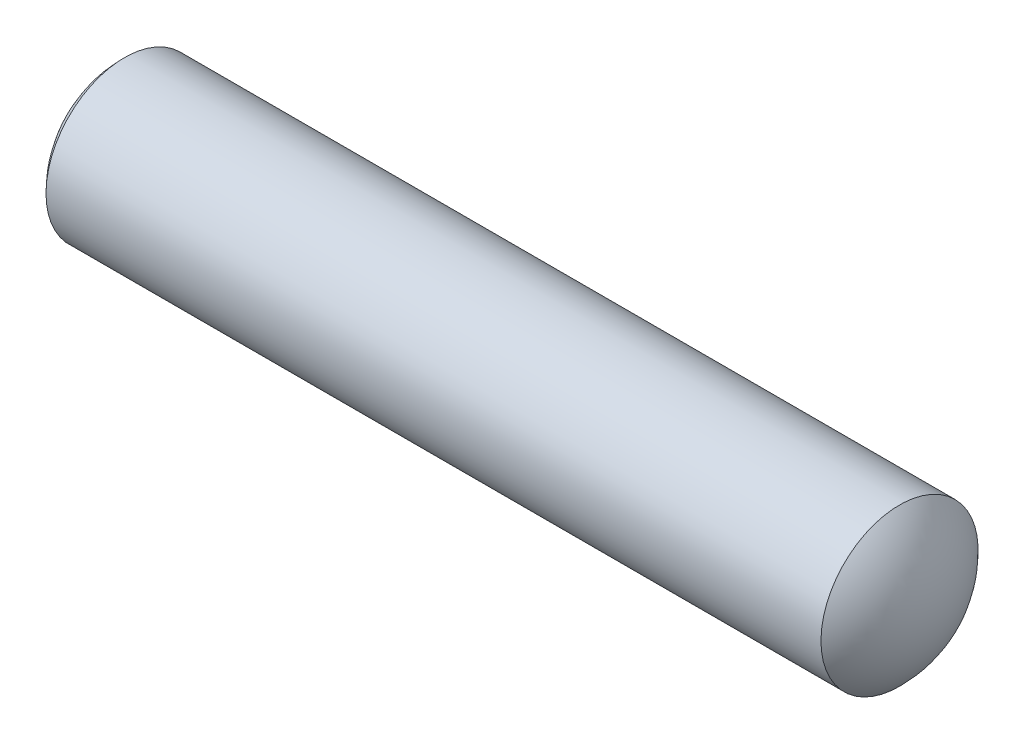
ISO-10303-21;
HEADER;
FILE_DESCRIPTION(('STEP AP214'),'2;1');
FILE_NAME('part.step','',(''),(''),'','','');
FILE_SCHEMA(('AUTOMOTIVE_DESIGN { 1 0 10303 214 1 1 1 1 }'));
ENDSEC;
DATA;
#1=APPLICATION_CONTEXT('core data for automotive mechanical design processes');
#2=APPLICATION_PROTOCOL_DEFINITION('international standard','automotive_design',2000,#1);
#3=PRODUCT_CONTEXT('',#1,'mechanical');
#4=PRODUCT('Part','Part','',(#3));
#5=PRODUCT_RELATED_PRODUCT_CATEGORY('part','',(#4));
#6=PRODUCT_DEFINITION_FORMATION('','',#4);
#7=PRODUCT_DEFINITION_CONTEXT('part definition',#1,'design');
#8=PRODUCT_DEFINITION('design','',#6,#7);
#9=PRODUCT_DEFINITION_SHAPE('','',#8);
#10=(LENGTH_UNIT() NAMED_UNIT(*) SI_UNIT(.MILLI.,.METRE.));
#11=(NAMED_UNIT(*) PLANE_ANGLE_UNIT() SI_UNIT($,.RADIAN.));
#12=(NAMED_UNIT(*) SI_UNIT($,.STERADIAN.) SOLID_ANGLE_UNIT());
#13=UNCERTAINTY_MEASURE_WITH_UNIT(LENGTH_MEASURE(1.E-05),#10,'distance_accuracy_value','');
#14=(GEOMETRIC_REPRESENTATION_CONTEXT(3) GLOBAL_UNCERTAINTY_ASSIGNED_CONTEXT((#13)) GLOBAL_UNIT_ASSIGNED_CONTEXT((#10,
#11,#12)) REPRESENTATION_CONTEXT('',''));
#15=CARTESIAN_POINT('',(0.,0.,0.));
#16=DIRECTION('',(0.,0.,1.));
#17=DIRECTION('',(1.,0.,0.));
#18=AXIS2_PLACEMENT_3D('',#15,#16,#17);
#19=CARTESIAN_POINT('',(15.1875,-17.9292159184645,-11.5224074220224));
#20=DIRECTION('',(0.,0.540640817455597,-0.841253532831182));
#21=DIRECTION('',(1.,0.,0.));
#22=AXIS2_PLACEMENT_3D('',#19,#20,#21);
#23=SPHERICAL_SURFACE('',#22,1.8375);
#24=CARTESIAN_POINT('',(15.1875,-17.9292159184645,-11.5224074220224));
#25=DIRECTION('',(-1.,0.,0.));
#26=DIRECTION('',(0.,0.841253532831181,0.540640817455598));
#27=AXIS2_PLACEMENT_3D('',#24,#25,#26);
#28=SPHERICAL_SURFACE('',#27,1.8375);
#29=CARTESIAN_POINT('',(16.4734821149612,-17.9292159184645,-11.5224074220224));
#30=DIRECTION('',(-1.,0.,0.));
#31=DIRECTION('',(0.,0.841253532831181,0.540640817455598));
#32=AXIS2_PLACEMENT_3D('',#29,#30,#31);
#33=CIRCLE('',#32,1.3125);
#34=CARTESIAN_POINT('',(16.4734821149612,-16.8250706566236,-10.8128163491119));
#35=VERTEX_POINT('',#34);
#36=EDGE_CURVE('E11',#35,#35,#33,.T.);
#37=ORIENTED_EDGE('',*,*,#36,.F.);
#38=EDGE_LOOP('',(#37));
#39=FACE_BOUND('',#38,.T.);
#40=ADVANCED_FACE('F17',(#39),#28,.T.);
#41=CARTESIAN_POINT('',(10.,-17.9292159184645,-11.5224074220224));
#42=DIRECTION('',(-1.,0.,0.));
#43=DIRECTION('',(0.,0.841253532831181,0.540640817455598));
#44=AXIS2_PLACEMENT_3D('',#41,#42,#43);
#45=CYLINDRICAL_SURFACE('',#44,1.3125);
#46=CARTESIAN_POINT('',(3.52651788503884,-17.9292159184645,-11.5224074220224));
#47=DIRECTION('',(-1.,0.,0.));
#48=DIRECTION('',(0.,0.841253532831181,0.540640817455598));
#49=AXIS2_PLACEMENT_3D('',#46,#47,#48);
#50=CIRCLE('',#49,1.3125);
#51=CARTESIAN_POINT('',(3.52651788503884,-16.8250706566236,-10.8128163491119));
#52=VERTEX_POINT('',#51);
#53=EDGE_CURVE('E27',#52,#52,#50,.T.);
#54=ORIENTED_EDGE('',*,*,#53,.F.);
#55=EDGE_LOOP('',(#54));
#56=FACE_BOUND('',#55,.T.);
#57=ORIENTED_EDGE('',*,*,#36,.T.);
#58=EDGE_LOOP('',(#57));
#59=FACE_BOUND('',#58,.T.);
#60=ADVANCED_FACE('F47',(#56,#59),#45,.T.);
#61=CARTESIAN_POINT('',(4.8125,-17.9292159184645,-11.5224074220224));
#62=DIRECTION('',(0.,0.540640817455597,-0.841253532831182));
#63=DIRECTION('',(-1.,0.,0.));
#64=AXIS2_PLACEMENT_3D('',#61,#62,#63);
#65=SPHERICAL_SURFACE('',#64,1.8375);
#66=CARTESIAN_POINT('',(4.8125,-17.9292159184645,-11.5224074220224));
#67=DIRECTION('',(-1.,0.,0.));
#68=DIRECTION('',(0.,0.841253532831181,0.540640817455598));
#69=AXIS2_PLACEMENT_3D('',#66,#67,#68);
#70=SPHERICAL_SURFACE('',#69,1.8375);
#71=ORIENTED_EDGE('',*,*,#53,.T.);
#72=EDGE_LOOP('',(#71));
#73=FACE_BOUND('',#72,.T.);
#74=ADVANCED_FACE('F19',(#73),#70,.T.);
#75=CLOSED_SHELL('',(#40,#60,#74));
#76=MANIFOLD_SOLID_BREP('B1',#75);
#77=ADVANCED_BREP_SHAPE_REPRESENTATION('',(#18,#76),#14);
#78=SHAPE_DEFINITION_REPRESENTATION(#9,#77);
ENDSEC;
END-ISO-10303-21;
